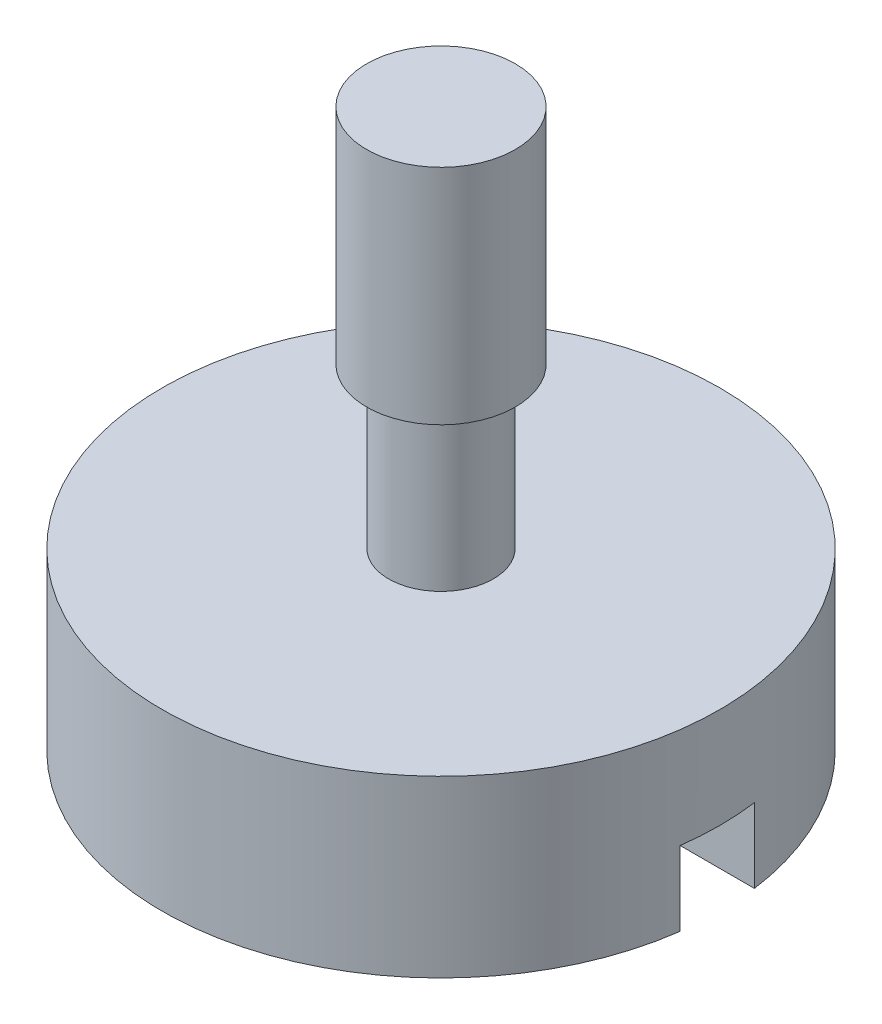
ISO-10303-21;
HEADER;
FILE_DESCRIPTION(('STEP AP214'),'2;1');
FILE_NAME('part.step','',(''),(''),'','','');
FILE_SCHEMA(('AUTOMOTIVE_DESIGN { 1 0 10303 214 1 1 1 1 }'));
ENDSEC;
DATA;
#1=APPLICATION_CONTEXT('core data for automotive mechanical design processes');
#2=APPLICATION_PROTOCOL_DEFINITION('international standard','automotive_design',2000,#1);
#3=PRODUCT_CONTEXT('',#1,'mechanical');
#4=PRODUCT('Part','Part','',(#3));
#5=PRODUCT_RELATED_PRODUCT_CATEGORY('part','',(#4));
#6=PRODUCT_DEFINITION_FORMATION('','',#4);
#7=PRODUCT_DEFINITION_CONTEXT('part definition',#1,'design');
#8=PRODUCT_DEFINITION('design','',#6,#7);
#9=PRODUCT_DEFINITION_SHAPE('','',#8);
#10=(LENGTH_UNIT() NAMED_UNIT(*) SI_UNIT(.MILLI.,.METRE.));
#11=(NAMED_UNIT(*) PLANE_ANGLE_UNIT() SI_UNIT($,.RADIAN.));
#12=(NAMED_UNIT(*) SI_UNIT($,.STERADIAN.) SOLID_ANGLE_UNIT());
#13=UNCERTAINTY_MEASURE_WITH_UNIT(LENGTH_MEASURE(1.E-05),#10,'distance_accuracy_value','');
#14=(GEOMETRIC_REPRESENTATION_CONTEXT(3) GLOBAL_UNCERTAINTY_ASSIGNED_CONTEXT((#13)) GLOBAL_UNIT_ASSIGNED_CONTEXT((#10,
#11,#12)) REPRESENTATION_CONTEXT('',''));
#15=CARTESIAN_POINT('',(0.,0.,0.));
#16=DIRECTION('',(0.,0.,1.));
#17=DIRECTION('',(1.,0.,0.));
#18=AXIS2_PLACEMENT_3D('',#15,#16,#17);
#19=CARTESIAN_POINT('',(7.5,0.,0.));
#20=DIRECTION('',(0.,-1.,0.));
#21=DIRECTION('',(0.,0.,-1.));
#22=AXIS2_PLACEMENT_3D('',#19,#20,#21);
#23=PLANE('',#22);
#24=DIRECTION('',(1.,0.,0.));
#25=VECTOR('',#24,1.);
#26=CARTESIAN_POINT('',(7.5,0.,-1.));
#27=LINE('',#26,#25);
#28=CARTESIAN_POINT('',(-7.43303437365925,0.,-1.));
#29=VERTEX_POINT('',#28);
#30=CARTESIAN_POINT('',(7.43303437365925,0.,-1.));
#31=VERTEX_POINT('',#30);
#32=EDGE_CURVE('E80',#29,#31,#27,.T.);
#33=ORIENTED_EDGE('',*,*,#32,.F.);
#34=CARTESIAN_POINT('',(0.,0.,0.));
#35=DIRECTION('',(0.,-1.,0.));
#36=DIRECTION('',(0.,0.,-1.));
#37=AXIS2_PLACEMENT_3D('',#34,#35,#36);
#38=CIRCLE('',#37,7.5);
#39=EDGE_CURVE('E92',#29,#31,#38,.T.);
#40=ORIENTED_EDGE('',*,*,#39,.T.);
#41=EDGE_LOOP('',(#33,#40));
#42=FACE_BOUND('',#41,.T.);
#43=ADVANCED_FACE('F32',(#42),#23,.T.);
#44=CARTESIAN_POINT('',(0.,15.,0.));
#45=DIRECTION('',(0.,1.,0.));
#46=DIRECTION('',(0.,0.,1.));
#47=AXIS2_PLACEMENT_3D('',#44,#45,#46);
#48=PLANE('',#47);
#49=CARTESIAN_POINT('',(0.,15.,0.));
#50=DIRECTION('',(0.,-1.,0.));
#51=DIRECTION('',(0.,0.,-1.));
#52=AXIS2_PLACEMENT_3D('',#49,#50,#51);
#53=CIRCLE('',#52,2.);
#54=CARTESIAN_POINT('',(0.,15.,-2.));
#55=VERTEX_POINT('',#54);
#56=EDGE_CURVE('E81',#55,#55,#53,.T.);
#57=ORIENTED_EDGE('',*,*,#56,.F.);
#58=EDGE_LOOP('',(#57));
#59=FACE_BOUND('',#58,.T.);
#60=ADVANCED_FACE('F34',(#59),#48,.T.);
#61=CARTESIAN_POINT('',(0.,-3.57829225234083,0.));
#62=DIRECTION('',(0.,-1.,0.));
#63=DIRECTION('',(0.,0.,-1.));
#64=AXIS2_PLACEMENT_3D('',#61,#62,#63);
#65=CYLINDRICAL_SURFACE('',#64,2.);
#66=ORIENTED_EDGE('',*,*,#56,.T.);
#67=EDGE_LOOP('',(#66));
#68=FACE_BOUND('',#67,.T.);
#69=CARTESIAN_POINT('',(0.,9.,0.));
#70=DIRECTION('',(0.,-1.,0.));
#71=DIRECTION('',(0.,0.,-1.));
#72=AXIS2_PLACEMENT_3D('',#69,#70,#71);
#73=CIRCLE('',#72,2.);
#74=CARTESIAN_POINT('',(0.,9.,-2.));
#75=VERTEX_POINT('',#74);
#76=EDGE_CURVE('E106',#75,#75,#73,.T.);
#77=ORIENTED_EDGE('',*,*,#76,.F.);
#78=EDGE_LOOP('',(#77));
#79=FACE_BOUND('',#78,.T.);
#80=ADVANCED_FACE('F127',(#68,#79),#65,.T.);
#81=CARTESIAN_POINT('',(2.,9.,0.));
#82=DIRECTION('',(0.,-1.,0.));
#83=DIRECTION('',(0.,0.,-1.));
#84=AXIS2_PLACEMENT_3D('',#81,#82,#83);
#85=PLANE('',#84);
#86=ORIENTED_EDGE('',*,*,#76,.T.);
#87=EDGE_LOOP('',(#86));
#88=FACE_BOUND('',#87,.T.);
#89=CARTESIAN_POINT('',(0.,9.,0.));
#90=DIRECTION('',(0.,-1.,0.));
#91=DIRECTION('',(0.,0.,-1.));
#92=AXIS2_PLACEMENT_3D('',#89,#90,#91);
#93=CIRCLE('',#92,1.40953383748865);
#94=CARTESIAN_POINT('',(0.,9.,-1.40953383748865));
#95=VERTEX_POINT('',#94);
#96=EDGE_CURVE('E103',#95,#95,#93,.T.);
#97=ORIENTED_EDGE('',*,*,#96,.F.);
#98=EDGE_LOOP('',(#97));
#99=FACE_BOUND('',#98,.T.);
#100=ADVANCED_FACE('F147',(#88,#99),#85,.T.);
#101=CARTESIAN_POINT('',(0.,-3.57829225234083,0.));
#102=DIRECTION('',(0.,-1.,0.));
#103=DIRECTION('',(0.,0.,-1.));
#104=AXIS2_PLACEMENT_3D('',#101,#102,#103);
#105=CYLINDRICAL_SURFACE('',#104,1.40953383748865);
#106=ORIENTED_EDGE('',*,*,#96,.T.);
#107=EDGE_LOOP('',(#106));
#108=FACE_BOUND('',#107,.T.);
#109=CARTESIAN_POINT('',(0.,4.7,0.));
#110=DIRECTION('',(0.,-1.,0.));
#111=DIRECTION('',(0.,0.,-1.));
#112=AXIS2_PLACEMENT_3D('',#109,#110,#111);
#113=CIRCLE('',#112,1.40953383748865);
#114=CARTESIAN_POINT('',(0.,4.7,-1.40953383748865));
#115=VERTEX_POINT('',#114);
#116=EDGE_CURVE('E95',#115,#115,#113,.T.);
#117=ORIENTED_EDGE('',*,*,#116,.F.);
#118=EDGE_LOOP('',(#117));
#119=FACE_BOUND('',#118,.T.);
#120=ADVANCED_FACE('F141',(#108,#119),#105,.T.);
#121=CARTESIAN_POINT('',(1.40953383748865,4.7,0.));
#122=DIRECTION('',(0.,1.,0.));
#123=DIRECTION('',(0.,0.,1.));
#124=AXIS2_PLACEMENT_3D('',#121,#122,#123);
#125=PLANE('',#124);
#126=ORIENTED_EDGE('',*,*,#116,.T.);
#127=EDGE_LOOP('',(#126));
#128=FACE_BOUND('',#127,.T.);
#129=CARTESIAN_POINT('',(0.,4.7,0.));
#130=DIRECTION('',(0.,-1.,0.));
#131=DIRECTION('',(0.,0.,-1.));
#132=AXIS2_PLACEMENT_3D('',#129,#130,#131);
#133=CIRCLE('',#132,7.5);
#134=CARTESIAN_POINT('',(0.,4.7,-7.5));
#135=VERTEX_POINT('',#134);
#136=EDGE_CURVE('E91',#135,#135,#133,.T.);
#137=ORIENTED_EDGE('',*,*,#136,.F.);
#138=EDGE_LOOP('',(#137));
#139=FACE_BOUND('',#138,.T.);
#140=ADVANCED_FACE('F137',(#128,#139),#125,.T.);
#141=CARTESIAN_POINT('',(0.,-3.57829225234083,0.));
#142=DIRECTION('',(0.,-1.,0.));
#143=DIRECTION('',(0.,0.,-1.));
#144=AXIS2_PLACEMENT_3D('',#141,#142,#143);
#145=CYLINDRICAL_SURFACE('',#144,7.5);
#146=DIRECTION('',(0.,-1.,0.));
#147=VECTOR('',#146,1.);
#148=CARTESIAN_POINT('',(-7.43303437365925,-3.57829225234083,-1.));
#149=LINE('',#148,#147);
#150=CARTESIAN_POINT('',(-7.43303437365925,2.,-1.));
#151=VERTEX_POINT('',#150);
#152=EDGE_CURVE('E88',#151,#29,#149,.T.);
#153=ORIENTED_EDGE('',*,*,#152,.F.);
#154=CARTESIAN_POINT('',(0.,2.,0.));
#155=DIRECTION('',(0.,-1.,0.));
#156=DIRECTION('',(0.,0.,-1.));
#157=AXIS2_PLACEMENT_3D('',#154,#155,#156);
#158=CIRCLE('',#157,7.5);
#159=CARTESIAN_POINT('',(-7.43303437365925,2.,1.));
#160=VERTEX_POINT('',#159);
#161=EDGE_CURVE('E11',#151,#160,#158,.F.);
#162=ORIENTED_EDGE('',*,*,#161,.T.);
#163=DIRECTION('',(0.,-1.,0.));
#164=VECTOR('',#163,1.);
#165=CARTESIAN_POINT('',(-7.43303437365925,-3.57829225234083,1.));
#166=LINE('',#165,#164);
#167=CARTESIAN_POINT('',(-7.43303437365925,0.,1.));
#168=VERTEX_POINT('',#167);
#169=EDGE_CURVE('E75',#168,#160,#166,.F.);
#170=ORIENTED_EDGE('',*,*,#169,.F.);
#171=CARTESIAN_POINT('',(7.43303437365925,0.,1.));
#172=VERTEX_POINT('',#171);
#173=EDGE_CURVE('E87',#172,#168,#38,.T.);
#174=ORIENTED_EDGE('',*,*,#173,.F.);
#175=DIRECTION('',(0.,-1.,0.));
#176=VECTOR('',#175,1.);
#177=CARTESIAN_POINT('',(7.43303437365925,-3.57829225234083,1.));
#178=LINE('',#177,#176);
#179=CARTESIAN_POINT('',(7.43303437365925,2.,1.));
#180=VERTEX_POINT('',#179);
#181=EDGE_CURVE('E47',#180,#172,#178,.T.);
#182=ORIENTED_EDGE('',*,*,#181,.F.);
#183=CARTESIAN_POINT('',(7.43303437365925,2.,-1.));
#184=VERTEX_POINT('',#183);
#185=EDGE_CURVE('E36',#180,#184,#158,.F.);
#186=ORIENTED_EDGE('',*,*,#185,.T.);
#187=DIRECTION('',(0.,-1.,0.));
#188=VECTOR('',#187,1.);
#189=CARTESIAN_POINT('',(7.43303437365925,-3.57829225234083,-1.));
#190=LINE('',#189,#188);
#191=EDGE_CURVE('E55',#31,#184,#190,.F.);
#192=ORIENTED_EDGE('',*,*,#191,.F.);
#193=ORIENTED_EDGE('',*,*,#39,.F.);
#194=EDGE_LOOP('',(#153,#162,#170,#174,#182,#186,#192,#193));
#195=FACE_BOUND('',#194,.T.);
#196=ORIENTED_EDGE('',*,*,#136,.T.);
#197=EDGE_LOOP('',(#196));
#198=FACE_BOUND('',#197,.T.);
#199=ADVANCED_FACE('F85',(#195,#198),#145,.T.);
#200=DIRECTION('',(-1.,0.,0.));
#201=VECTOR('',#200,1.);
#202=CARTESIAN_POINT('',(7.5,0.,1.));
#203=LINE('',#202,#201);
#204=EDGE_CURVE('E72',#172,#168,#203,.T.);
#205=ORIENTED_EDGE('',*,*,#204,.F.);
#206=ORIENTED_EDGE('',*,*,#173,.T.);
#207=EDGE_LOOP('',(#205,#206));
#208=FACE_BOUND('',#207,.T.);
#209=ADVANCED_FACE('F90',(#208),#23,.T.);
#210=CARTESIAN_POINT('',(-10.0577952546729,2.,-1.));
#211=DIRECTION('',(0.,0.,-1.));
#212=DIRECTION('',(-1.,0.,0.));
#213=AXIS2_PLACEMENT_3D('',#210,#211,#212);
#214=PLANE('',#213);
#215=ORIENTED_EDGE('',*,*,#191,.T.);
#216=DIRECTION('',(1.,0.,0.));
#217=VECTOR('',#216,1.);
#218=CARTESIAN_POINT('',(-10.0577952546729,2.,-1.));
#219=LINE('',#218,#217);
#220=EDGE_CURVE('E116',#151,#184,#219,.T.);
#221=ORIENTED_EDGE('',*,*,#220,.F.);
#222=ORIENTED_EDGE('',*,*,#152,.T.);
#223=ORIENTED_EDGE('',*,*,#32,.T.);
#224=EDGE_LOOP('',(#215,#221,#222,#223));
#225=FACE_BOUND('',#224,.T.);
#226=ADVANCED_FACE('F120',(#225),#214,.F.);
#227=CARTESIAN_POINT('',(-10.0577952546729,2.,1.));
#228=DIRECTION('',(0.,0.,1.));
#229=DIRECTION('',(1.,0.,0.));
#230=AXIS2_PLACEMENT_3D('',#227,#228,#229);
#231=PLANE('',#230);
#232=ORIENTED_EDGE('',*,*,#169,.T.);
#233=DIRECTION('',(-1.,0.,0.));
#234=VECTOR('',#233,1.);
#235=CARTESIAN_POINT('',(-10.0577952546729,2.,1.));
#236=LINE('',#235,#234);
#237=EDGE_CURVE('E115',#180,#160,#236,.T.);
#238=ORIENTED_EDGE('',*,*,#237,.F.);
#239=ORIENTED_EDGE('',*,*,#181,.T.);
#240=ORIENTED_EDGE('',*,*,#204,.T.);
#241=EDGE_LOOP('',(#232,#238,#239,#240));
#242=FACE_BOUND('',#241,.T.);
#243=ADVANCED_FACE('F74',(#242),#231,.F.);
#244=CARTESIAN_POINT('',(0.,2.,0.));
#245=DIRECTION('',(0.,-1.,0.));
#246=DIRECTION('',(0.,0.,-1.));
#247=AXIS2_PLACEMENT_3D('',#244,#245,#246);
#248=PLANE('',#247);
#249=ORIENTED_EDGE('',*,*,#220,.T.);
#250=ORIENTED_EDGE('',*,*,#185,.F.);
#251=ORIENTED_EDGE('',*,*,#237,.T.);
#252=ORIENTED_EDGE('',*,*,#161,.F.);
#253=EDGE_LOOP('',(#249,#250,#251,#252));
#254=FACE_BOUND('',#253,.T.);
#255=ADVANCED_FACE('F114',(#254),#248,.T.);
#256=CLOSED_SHELL('',(#43,#60,#80,#100,#120,#140,#199,#209,#226,#243,#255));
#257=MANIFOLD_SOLID_BREP('B2',#256);
#258=ADVANCED_BREP_SHAPE_REPRESENTATION('',(#18,#257),#14);
#259=SHAPE_DEFINITION_REPRESENTATION(#9,#258);
ENDSEC;
END-ISO-10303-21;
